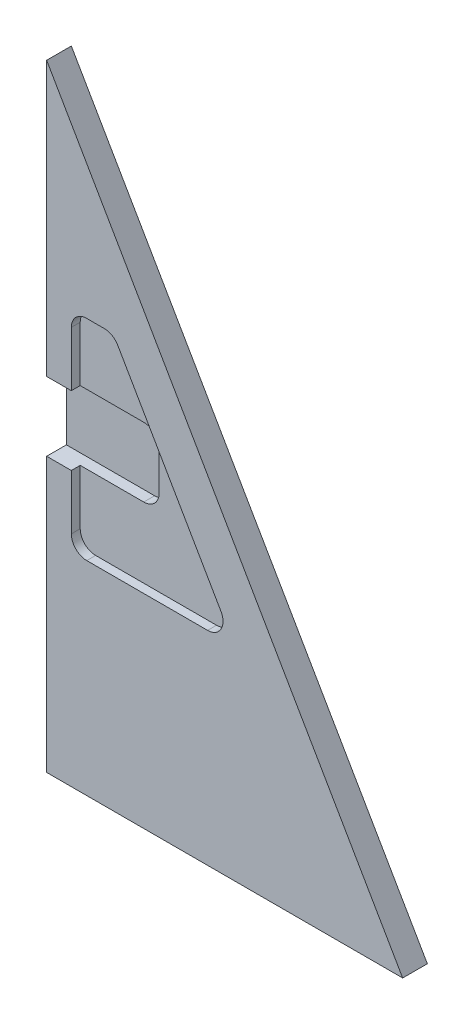
ISO-10303-21;
HEADER;
FILE_DESCRIPTION(('STEP AP214'),'2;1');
FILE_NAME('part.step','',(''),(''),'','','');
FILE_SCHEMA(('AUTOMOTIVE_DESIGN { 1 0 10303 214 1 1 1 1 }'));
ENDSEC;
DATA;
#1=APPLICATION_CONTEXT('core data for automotive mechanical design processes');
#2=APPLICATION_PROTOCOL_DEFINITION('international standard','automotive_design',2000,#1);
#3=PRODUCT_CONTEXT('',#1,'mechanical');
#4=PRODUCT('Part','Part','',(#3));
#5=PRODUCT_RELATED_PRODUCT_CATEGORY('part','',(#4));
#6=PRODUCT_DEFINITION_FORMATION('','',#4);
#7=PRODUCT_DEFINITION_CONTEXT('part definition',#1,'design');
#8=PRODUCT_DEFINITION('design','',#6,#7);
#9=PRODUCT_DEFINITION_SHAPE('','',#8);
#10=(LENGTH_UNIT() NAMED_UNIT(*) SI_UNIT(.MILLI.,.METRE.));
#11=(NAMED_UNIT(*) PLANE_ANGLE_UNIT() SI_UNIT($,.RADIAN.));
#12=(NAMED_UNIT(*) SI_UNIT($,.STERADIAN.) SOLID_ANGLE_UNIT());
#13=UNCERTAINTY_MEASURE_WITH_UNIT(LENGTH_MEASURE(1.E-05),#10,'distance_accuracy_value','');
#14=(GEOMETRIC_REPRESENTATION_CONTEXT(3) GLOBAL_UNCERTAINTY_ASSIGNED_CONTEXT((#13)) GLOBAL_UNIT_ASSIGNED_CONTEXT((#10,
#11,#12)) REPRESENTATION_CONTEXT('',''));
#15=CARTESIAN_POINT('',(0.,0.,0.));
#16=DIRECTION('',(0.,0.,1.));
#17=DIRECTION('',(1.,0.,0.));
#18=AXIS2_PLACEMENT_3D('',#15,#16,#17);
#19=CARTESIAN_POINT('',(0.,0.,-2.54));
#20=DIRECTION('',(-1.,0.,0.));
#21=DIRECTION('',(0.,0.,1.));
#22=AXIS2_PLACEMENT_3D('',#19,#20,#21);
#23=PLANE('',#22);
#24=DIRECTION('',(0.,0.,1.));
#25=VECTOR('',#24,1.);
#26=CARTESIAN_POINT('',(0.,35.306,-2.032));
#27=LINE('',#26,#25);
#28=CARTESIAN_POINT('',(0.,35.306,-2.032));
#29=VERTEX_POINT('',#28);
#30=CARTESIAN_POINT('',(0.,35.306,0.));
#31=VERTEX_POINT('',#30);
#32=EDGE_CURVE('E238',#29,#31,#27,.T.);
#33=ORIENTED_EDGE('',*,*,#32,.T.);
#34=DIRECTION('',(0.,-1.,0.));
#35=VECTOR('',#34,1.);
#36=CARTESIAN_POINT('',(0.,0.,0.));
#37=LINE('',#36,#35);
#38=CARTESIAN_POINT('',(0.,63.5,0.));
#39=VERTEX_POINT('',#38);
#40=EDGE_CURVE('E223',#39,#31,#37,.T.);
#41=ORIENTED_EDGE('',*,*,#40,.F.);
#42=DIRECTION('',(0.,0.,1.));
#43=VECTOR('',#42,1.);
#44=CARTESIAN_POINT('',(0.,63.5,-2.54));
#45=LINE('',#44,#43);
#46=CARTESIAN_POINT('',(0.,63.5,-2.54));
#47=VERTEX_POINT('',#46);
#48=EDGE_CURVE('E267',#47,#39,#45,.T.);
#49=ORIENTED_EDGE('',*,*,#48,.F.);
#50=DIRECTION('',(0.,-1.,0.));
#51=VECTOR('',#50,1.);
#52=CARTESIAN_POINT('',(0.,0.,-2.54));
#53=LINE('',#52,#51);
#54=CARTESIAN_POINT('',(0.,0.,-2.54));
#55=VERTEX_POINT('',#54);
#56=EDGE_CURVE('E246',#47,#55,#53,.T.);
#57=ORIENTED_EDGE('',*,*,#56,.T.);
#58=DIRECTION('',(0.,0.,1.));
#59=VECTOR('',#58,1.);
#60=CARTESIAN_POINT('',(0.,0.,-2.54));
#61=LINE('',#60,#59);
#62=CARTESIAN_POINT('',(0.,0.,0.));
#63=VERTEX_POINT('',#62);
#64=EDGE_CURVE('E259',#55,#63,#61,.T.);
#65=ORIENTED_EDGE('',*,*,#64,.T.);
#66=CARTESIAN_POINT('',(0.,28.194,0.));
#67=VERTEX_POINT('',#66);
#68=EDGE_CURVE('E241',#67,#63,#37,.T.);
#69=ORIENTED_EDGE('',*,*,#68,.F.);
#70=DIRECTION('',(0.,0.,1.));
#71=VECTOR('',#70,1.);
#72=CARTESIAN_POINT('',(0.,28.194,-2.032));
#73=LINE('',#72,#71);
#74=CARTESIAN_POINT('',(0.,28.194,-2.032));
#75=VERTEX_POINT('',#74);
#76=EDGE_CURVE('E242',#75,#67,#73,.T.);
#77=ORIENTED_EDGE('',*,*,#76,.F.);
#78=DIRECTION('',(0.,-1.,0.));
#79=VECTOR('',#78,1.);
#80=CARTESIAN_POINT('',(0.,31.75,-2.032));
#81=LINE('',#80,#79);
#82=EDGE_CURVE('E225',#29,#75,#81,.T.);
#83=ORIENTED_EDGE('',*,*,#82,.F.);
#84=EDGE_LOOP('',(#33,#41,#49,#57,#65,#69,#77,#83));
#85=FACE_BOUND('',#84,.T.);
#86=ADVANCED_FACE('F38',(#85),#23,.T.);
#87=CARTESIAN_POINT('',(0.,63.5,-2.54));
#88=DIRECTION('',(0.866081752896378,0.49990238777179,0.));
#89=DIRECTION('',(-0.49990238777179,0.866081752896378,0.));
#90=AXIS2_PLACEMENT_3D('',#87,#88,#89);
#91=PLANE('',#90);
#92=DIRECTION('',(-0.49990238777179,0.866081752896378,0.));
#93=VECTOR('',#92,1.);
#94=CARTESIAN_POINT('',(0.,63.5,0.));
#95=LINE('',#94,#93);
#96=CARTESIAN_POINT('',(36.6522,0.,0.));
#97=VERTEX_POINT('',#96);
#98=EDGE_CURVE('E251',#97,#39,#95,.T.);
#99=ORIENTED_EDGE('',*,*,#98,.F.);
#100=DIRECTION('',(0.,0.,1.));
#101=VECTOR('',#100,1.);
#102=CARTESIAN_POINT('',(36.6522,0.,-2.54));
#103=LINE('',#102,#101);
#104=CARTESIAN_POINT('',(36.6522,0.,-2.54));
#105=VERTEX_POINT('',#104);
#106=EDGE_CURVE('E271',#105,#97,#103,.T.);
#107=ORIENTED_EDGE('',*,*,#106,.F.);
#108=DIRECTION('',(-0.49990238777179,0.866081752896378,0.));
#109=VECTOR('',#108,1.);
#110=CARTESIAN_POINT('',(0.,63.5,-2.54));
#111=LINE('',#110,#109);
#112=EDGE_CURVE('E255',#105,#47,#111,.T.);
#113=ORIENTED_EDGE('',*,*,#112,.T.);
#114=ORIENTED_EDGE('',*,*,#48,.T.);
#115=EDGE_LOOP('',(#99,#107,#113,#114));
#116=FACE_BOUND('',#115,.T.);
#117=ADVANCED_FACE('F433',(#116),#91,.T.);
#118=CARTESIAN_POINT('',(0.,0.,-2.54));
#119=DIRECTION('',(0.,-1.,0.));
#120=DIRECTION('',(0.,0.,-1.));
#121=AXIS2_PLACEMENT_3D('',#118,#119,#120);
#122=PLANE('',#121);
#123=DIRECTION('',(1.,0.,0.));
#124=VECTOR('',#123,1.);
#125=CARTESIAN_POINT('',(0.,0.,0.));
#126=LINE('',#125,#124);
#127=EDGE_CURVE('E261',#63,#97,#126,.T.);
#128=ORIENTED_EDGE('',*,*,#127,.F.);
#129=ORIENTED_EDGE('',*,*,#64,.F.);
#130=DIRECTION('',(1.,0.,0.));
#131=VECTOR('',#130,1.);
#132=CARTESIAN_POINT('',(0.,0.,-2.54));
#133=LINE('',#132,#131);
#134=EDGE_CURVE('E250',#55,#105,#133,.T.);
#135=ORIENTED_EDGE('',*,*,#134,.T.);
#136=ORIENTED_EDGE('',*,*,#106,.T.);
#137=EDGE_LOOP('',(#128,#129,#135,#136));
#138=FACE_BOUND('',#137,.T.);
#139=ADVANCED_FACE('F437',(#138),#122,.T.);
#140=CARTESIAN_POINT('',(0.,0.,-2.54));
#141=DIRECTION('',(0.,0.,-1.));
#142=DIRECTION('',(-1.,0.,0.));
#143=AXIS2_PLACEMENT_3D('',#140,#141,#142);
#144=PLANE('',#143);
#145=ORIENTED_EDGE('',*,*,#56,.F.);
#146=ORIENTED_EDGE('',*,*,#112,.F.);
#147=ORIENTED_EDGE('',*,*,#134,.F.);
#148=EDGE_LOOP('',(#145,#146,#147));
#149=FACE_BOUND('',#148,.T.);
#150=ADVANCED_FACE('F442',(#149),#144,.T.);
#151=CARTESIAN_POINT('',(0.,0.,0.));
#152=DIRECTION('',(0.,0.,-1.));
#153=DIRECTION('',(-1.,0.,0.));
#154=AXIS2_PLACEMENT_3D('',#151,#152,#153);
#155=PLANE('',#154);
#156=DIRECTION('',(1.,0.,0.));
#157=VECTOR('',#156,1.);
#158=CARTESIAN_POINT('',(2.54000000000009,20.955,0.));
#159=LINE('',#158,#157);
#160=CARTESIAN_POINT('',(4.12750000000009,20.955,0.));
#161=VERTEX_POINT('',#160);
#162=CARTESIAN_POINT('',(16.5704751598497,20.9550000000001,0.));
#163=VERTEX_POINT('',#162);
#164=EDGE_CURVE('E355',#161,#163,#159,.T.);
#165=ORIENTED_EDGE('',*,*,#164,.F.);
#166=CARTESIAN_POINT('',(4.12750000000007,22.5425,0.));
#167=DIRECTION('',(0.,0.,-1.));
#168=DIRECTION('',(-1.,0.,0.));
#169=AXIS2_PLACEMENT_3D('',#166,#167,#168);
#170=CIRCLE('',#169,1.5875);
#171=CARTESIAN_POINT('',(2.54000000000007,22.5425,0.));
#172=VERTEX_POINT('',#171);
#173=EDGE_CURVE('E11',#161,#172,#170,.T.);
#174=ORIENTED_EDGE('',*,*,#173,.T.);
#175=DIRECTION('',(0.,-1.,0.));
#176=VECTOR('',#175,1.);
#177=CARTESIAN_POINT('',(2.54000000000001,31.75,0.));
#178=LINE('',#177,#176);
#179=CARTESIAN_POINT('',(2.54000000000003,28.194,0.));
#180=VERTEX_POINT('',#179);
#181=EDGE_CURVE('E204',#180,#172,#178,.T.);
#182=ORIENTED_EDGE('',*,*,#181,.F.);
#183=DIRECTION('',(1.,0.,0.));
#184=VECTOR('',#183,1.);
#185=CARTESIAN_POINT('',(0.,28.194,0.));
#186=LINE('',#185,#184);
#187=EDGE_CURVE('E217',#67,#180,#186,.T.);
#188=ORIENTED_EDGE('',*,*,#187,.F.);
#189=ORIENTED_EDGE('',*,*,#68,.T.);
#190=ORIENTED_EDGE('',*,*,#127,.T.);
#191=ORIENTED_EDGE('',*,*,#98,.T.);
#192=ORIENTED_EDGE('',*,*,#40,.T.);
#193=DIRECTION('',(-1.,0.,0.));
#194=VECTOR('',#193,1.);
#195=CARTESIAN_POINT('',(0.,35.306,0.));
#196=LINE('',#195,#194);
#197=CARTESIAN_POINT('',(2.53999999999998,35.306,0.));
#198=VERTEX_POINT('',#197);
#199=EDGE_CURVE('E210',#198,#31,#196,.T.);
#200=ORIENTED_EDGE('',*,*,#199,.F.);
#201=CARTESIAN_POINT('',(2.53999999999994,40.9575,0.));
#202=VERTEX_POINT('',#201);
#203=EDGE_CURVE('E194',#202,#198,#178,.T.);
#204=ORIENTED_EDGE('',*,*,#203,.F.);
#205=CARTESIAN_POINT('',(4.12749999999994,40.9575,0.));
#206=DIRECTION('',(0.,0.,-1.));
#207=DIRECTION('',(-1.,0.,0.));
#208=AXIS2_PLACEMENT_3D('',#205,#206,#207);
#209=CIRCLE('',#208,1.5875);
#210=CARTESIAN_POINT('',(4.12749999999993,42.545,0.));
#211=VERTEX_POINT('',#210);
#212=EDGE_CURVE('E332',#202,#211,#209,.T.);
#213=ORIENTED_EDGE('',*,*,#212,.T.);
#214=DIRECTION('',(-1.,0.,0.));
#215=VECTOR('',#214,1.);
#216=CARTESIAN_POINT('',(2.53999999999993,42.545,0.));
#217=LINE('',#216,#215);
#218=CARTESIAN_POINT('',(5.94133715984977,42.545,0.));
#219=VERTEX_POINT('',#218);
#220=EDGE_CURVE('E346',#219,#211,#217,.T.);
#221=ORIENTED_EDGE('',*,*,#220,.F.);
#222=CARTESIAN_POINT('',(5.94133715984978,40.9575,0.));
#223=DIRECTION('',(0.,0.,-1.));
#224=DIRECTION('',(-1.,0.,0.));
#225=AXIS2_PLACEMENT_3D('',#222,#223,#224);
#226=CIRCLE('',#225,1.5875);
#227=CARTESIAN_POINT('',(7.31624194257278,41.7510950405878,0.));
#228=VERTEX_POINT('',#227);
#229=EDGE_CURVE('E340',#219,#228,#226,.T.);
#230=ORIENTED_EDGE('',*,*,#229,.T.);
#231=DIRECTION('',(-0.49990238777179,0.866081752896378,0.));
#232=VECTOR('',#231,1.);
#233=CARTESIAN_POINT('',(19.319748,20.9550000000002,0.));
#234=LINE('',#233,#232);
#235=CARTESIAN_POINT('',(17.9453799425727,23.3360950405878,0.));
#236=VERTEX_POINT('',#235);
#237=EDGE_CURVE('E344',#236,#228,#234,.T.);
#238=ORIENTED_EDGE('',*,*,#237,.F.);
#239=CARTESIAN_POINT('',(16.5704751598497,22.5425000000001,0.));
#240=DIRECTION('',(0.,0.,-1.));
#241=DIRECTION('',(-1.,0.,0.));
#242=AXIS2_PLACEMENT_3D('',#239,#240,#241);
#243=CIRCLE('',#242,1.5875);
#244=EDGE_CURVE('E47',#236,#163,#243,.T.);
#245=ORIENTED_EDGE('',*,*,#244,.T.);
#246=EDGE_LOOP('',(#165,#174,#182,#188,#189,#190,#191,#192,#200,#204,#213,#221,#230,#238,#245));
#247=FACE_BOUND('',#246,.T.);
#248=ADVANCED_FACE('F220',(#247),#155,.F.);
#249=CARTESIAN_POINT('',(0.,35.306,-2.032));
#250=DIRECTION('',(0.,1.,0.));
#251=DIRECTION('',(0.,0.,1.));
#252=AXIS2_PLACEMENT_3D('',#249,#250,#251);
#253=PLANE('',#252);
#254=DIRECTION('',(-1.,0.,0.));
#255=VECTOR('',#254,1.);
#256=CARTESIAN_POINT('',(0.,35.306,-2.032));
#257=LINE('',#256,#255);
#258=CARTESIAN_POINT('',(9.0805,35.306,-2.032));
#259=VERTEX_POINT('',#258);
#260=EDGE_CURVE('E245',#259,#29,#257,.T.);
#261=ORIENTED_EDGE('',*,*,#260,.F.);
#262=DIRECTION('',(0.,0.,1.));
#263=VECTOR('',#262,1.);
#264=CARTESIAN_POINT('',(9.0805,35.306,-0.9144));
#265=LINE('',#264,#263);
#266=CARTESIAN_POINT('',(9.0805,35.306,-0.9144));
#267=VERTEX_POINT('',#266);
#268=EDGE_CURVE('E302',#259,#267,#265,.T.);
#269=ORIENTED_EDGE('',*,*,#268,.T.);
#270=DIRECTION('',(-1.,0.,0.));
#271=VECTOR('',#270,1.);
#272=CARTESIAN_POINT('',(0.,35.306,-0.9144));
#273=LINE('',#272,#271);
#274=CARTESIAN_POINT('',(2.53999999999998,35.306,-0.9144));
#275=VERTEX_POINT('',#274);
#276=EDGE_CURVE('E214',#267,#275,#273,.T.);
#277=ORIENTED_EDGE('',*,*,#276,.T.);
#278=DIRECTION('',(0.,0.,1.));
#279=VECTOR('',#278,1.);
#280=CARTESIAN_POINT('',(2.53999999999998,35.306,-2.032));
#281=LINE('',#280,#279);
#282=EDGE_CURVE('E198',#275,#198,#281,.T.);
#283=ORIENTED_EDGE('',*,*,#282,.T.);
#284=ORIENTED_EDGE('',*,*,#199,.T.);
#285=ORIENTED_EDGE('',*,*,#32,.F.);
#286=EDGE_LOOP('',(#261,#269,#277,#283,#284,#285));
#287=FACE_BOUND('',#286,.T.);
#288=ADVANCED_FACE('F208',(#287),#253,.F.);
#289=CARTESIAN_POINT('',(10.668,35.306,-2.032));
#290=DIRECTION('',(1.,0.,0.));
#291=DIRECTION('',(0.,0.,-1.));
#292=AXIS2_PLACEMENT_3D('',#289,#290,#291);
#293=PLANE('',#292);
#294=DIRECTION('',(0.,1.,0.));
#295=VECTOR('',#294,1.);
#296=CARTESIAN_POINT('',(10.668,35.306,-0.9144));
#297=LINE('',#296,#295);
#298=CARTESIAN_POINT('',(10.668,29.7815,-0.9144));
#299=VERTEX_POINT('',#298);
#300=CARTESIAN_POINT('',(10.668,33.7185,-0.9144));
#301=VERTEX_POINT('',#300);
#302=EDGE_CURVE('E370',#299,#301,#297,.T.);
#303=ORIENTED_EDGE('',*,*,#302,.T.);
#304=DIRECTION('',(0.,0.,1.));
#305=VECTOR('',#304,1.);
#306=CARTESIAN_POINT('',(10.668,33.7185,-2.032));
#307=LINE('',#306,#305);
#308=CARTESIAN_POINT('',(10.668,33.7185,-2.032));
#309=VERTEX_POINT('',#308);
#310=EDGE_CURVE('E308',#301,#309,#307,.F.);
#311=ORIENTED_EDGE('',*,*,#310,.T.);
#312=DIRECTION('',(0.,1.,0.));
#313=VECTOR('',#312,1.);
#314=CARTESIAN_POINT('',(10.668,35.306,-2.032));
#315=LINE('',#314,#313);
#316=CARTESIAN_POINT('',(10.668,29.7815,-2.032));
#317=VERTEX_POINT('',#316);
#318=EDGE_CURVE('E388',#317,#309,#315,.T.);
#319=ORIENTED_EDGE('',*,*,#318,.F.);
#320=DIRECTION('',(0.,0.,1.));
#321=VECTOR('',#320,1.);
#322=CARTESIAN_POINT('',(10.668,29.7815,-0.9144));
#323=LINE('',#322,#321);
#324=EDGE_CURVE('E304',#317,#299,#323,.T.);
#325=ORIENTED_EDGE('',*,*,#324,.T.);
#326=EDGE_LOOP('',(#303,#311,#319,#325));
#327=FACE_BOUND('',#326,.T.);
#328=ADVANCED_FACE('F452',(#327),#293,.F.);
#329=CARTESIAN_POINT('',(0.,28.194,-2.032));
#330=DIRECTION('',(0.,-1.,0.));
#331=DIRECTION('',(0.,0.,-1.));
#332=AXIS2_PLACEMENT_3D('',#329,#330,#331);
#333=PLANE('',#332);
#334=DIRECTION('',(1.,0.,0.));
#335=VECTOR('',#334,1.);
#336=CARTESIAN_POINT('',(0.,28.194,-0.9144));
#337=LINE('',#336,#335);
#338=CARTESIAN_POINT('',(2.54000000000003,28.194,-0.9144));
#339=VERTEX_POINT('',#338);
#340=CARTESIAN_POINT('',(9.0805,28.194,-0.9144));
#341=VERTEX_POINT('',#340);
#342=EDGE_CURVE('E270',#339,#341,#337,.T.);
#343=ORIENTED_EDGE('',*,*,#342,.T.);
#344=DIRECTION('',(0.,0.,1.));
#345=VECTOR('',#344,1.);
#346=CARTESIAN_POINT('',(9.0805,28.194,-2.032));
#347=LINE('',#346,#345);
#348=CARTESIAN_POINT('',(9.0805,28.194,-2.032));
#349=VERTEX_POINT('',#348);
#350=EDGE_CURVE('E315',#341,#349,#347,.F.);
#351=ORIENTED_EDGE('',*,*,#350,.T.);
#352=DIRECTION('',(1.,0.,0.));
#353=VECTOR('',#352,1.);
#354=CARTESIAN_POINT('',(0.,28.194,-2.032));
#355=LINE('',#354,#353);
#356=EDGE_CURVE('E231',#75,#349,#355,.T.);
#357=ORIENTED_EDGE('',*,*,#356,.F.);
#358=ORIENTED_EDGE('',*,*,#76,.T.);
#359=ORIENTED_EDGE('',*,*,#187,.T.);
#360=DIRECTION('',(0.,0.,-1.));
#361=VECTOR('',#360,1.);
#362=CARTESIAN_POINT('',(2.54000000000003,28.194,-2.032));
#363=LINE('',#362,#361);
#364=EDGE_CURVE('E279',#180,#339,#363,.T.);
#365=ORIENTED_EDGE('',*,*,#364,.T.);
#366=EDGE_LOOP('',(#343,#351,#357,#358,#359,#365));
#367=FACE_BOUND('',#366,.T.);
#368=ADVANCED_FACE('F403',(#367),#333,.F.);
#369=CARTESIAN_POINT('',(0.,28.194,-2.032));
#370=DIRECTION('',(0.,0.,1.));
#371=DIRECTION('',(1.,0.,0.));
#372=AXIS2_PLACEMENT_3D('',#369,#370,#371);
#373=PLANE('',#372);
#374=ORIENTED_EDGE('',*,*,#318,.T.);
#375=CARTESIAN_POINT('',(9.0805,33.7185,-2.032));
#376=DIRECTION('',(0.,0.,1.));
#377=DIRECTION('',(1.,0.,0.));
#378=AXIS2_PLACEMENT_3D('',#375,#376,#377);
#379=CIRCLE('',#378,1.5875);
#380=EDGE_CURVE('E313',#309,#259,#379,.T.);
#381=ORIENTED_EDGE('',*,*,#380,.T.);
#382=ORIENTED_EDGE('',*,*,#260,.T.);
#383=ORIENTED_EDGE('',*,*,#82,.T.);
#384=ORIENTED_EDGE('',*,*,#356,.T.);
#385=CARTESIAN_POINT('',(9.0805,29.7815,-2.032));
#386=DIRECTION('',(0.,0.,1.));
#387=DIRECTION('',(1.,0.,0.));
#388=AXIS2_PLACEMENT_3D('',#385,#386,#387);
#389=CIRCLE('',#388,1.5875);
#390=EDGE_CURVE('E310',#349,#317,#389,.T.);
#391=ORIENTED_EDGE('',*,*,#390,.T.);
#392=EDGE_LOOP('',(#374,#381,#382,#383,#384,#391));
#393=FACE_BOUND('',#392,.T.);
#394=ADVANCED_FACE('F394',(#393),#373,.T.);
#395=CARTESIAN_POINT('',(2.54000000000001,31.75,-0.9144));
#396=DIRECTION('',(-1.,0.,0.));
#397=DIRECTION('',(0.,-1.,0.));
#398=AXIS2_PLACEMENT_3D('',#395,#396,#397);
#399=PLANE('',#398);
#400=DIRECTION('',(0.,-1.,0.));
#401=VECTOR('',#400,1.);
#402=CARTESIAN_POINT('',(2.54000000000009,20.955,-0.9144));
#403=LINE('',#402,#401);
#404=CARTESIAN_POINT('',(2.53999999999994,40.9575,-0.9144));
#405=VERTEX_POINT('',#404);
#406=EDGE_CURVE('E410',#405,#275,#403,.T.);
#407=ORIENTED_EDGE('',*,*,#406,.F.);
#408=DIRECTION('',(0.,0.,1.));
#409=VECTOR('',#408,1.);
#410=CARTESIAN_POINT('',(2.53999999999994,40.9575,0.));
#411=LINE('',#410,#409);
#412=EDGE_CURVE('E200',#405,#202,#411,.T.);
#413=ORIENTED_EDGE('',*,*,#412,.T.);
#414=ORIENTED_EDGE('',*,*,#203,.T.);
#415=ORIENTED_EDGE('',*,*,#282,.F.);
#416=EDGE_LOOP('',(#407,#413,#414,#415));
#417=FACE_BOUND('',#416,.T.);
#418=ADVANCED_FACE('F197',(#417),#399,.F.);
#419=ORIENTED_EDGE('',*,*,#181,.T.);
#420=DIRECTION('',(0.,0.,1.));
#421=VECTOR('',#420,1.);
#422=CARTESIAN_POINT('',(2.54000000000007,22.5425,-0.9144));
#423=LINE('',#422,#421);
#424=CARTESIAN_POINT('',(2.54000000000007,22.5425,-0.9144));
#425=VERTEX_POINT('',#424);
#426=EDGE_CURVE('E329',#172,#425,#423,.F.);
#427=ORIENTED_EDGE('',*,*,#426,.T.);
#428=EDGE_CURVE('E203',#339,#425,#403,.T.);
#429=ORIENTED_EDGE('',*,*,#428,.F.);
#430=ORIENTED_EDGE('',*,*,#364,.F.);
#431=EDGE_LOOP('',(#419,#427,#429,#430));
#432=FACE_BOUND('',#431,.T.);
#433=ADVANCED_FACE('F466',(#432),#399,.F.);
#434=CARTESIAN_POINT('',(2.53999999999993,42.545,-0.9144));
#435=DIRECTION('',(0.,0.,-1.));
#436=DIRECTION('',(-1.,0.,0.));
#437=AXIS2_PLACEMENT_3D('',#434,#435,#436);
#438=PLANE('',#437);
#439=DIRECTION('',(-1.,0.,0.));
#440=VECTOR('',#439,1.);
#441=CARTESIAN_POINT('',(2.53999999999993,42.545,-0.9144));
#442=LINE('',#441,#440);
#443=CARTESIAN_POINT('',(5.94133715984977,42.545,-0.9144));
#444=VERTEX_POINT('',#443);
#445=CARTESIAN_POINT('',(4.12749999999993,42.545,-0.9144));
#446=VERTEX_POINT('',#445);
#447=EDGE_CURVE('E363',#444,#446,#442,.T.);
#448=ORIENTED_EDGE('',*,*,#447,.T.);
#449=CARTESIAN_POINT('',(4.12749999999994,40.9575,-0.9144));
#450=DIRECTION('',(0.,0.,-1.));
#451=DIRECTION('',(-1.,0.,0.));
#452=AXIS2_PLACEMENT_3D('',#449,#450,#451);
#453=CIRCLE('',#452,1.5875);
#454=EDGE_CURVE('E300',#446,#405,#453,.F.);
#455=ORIENTED_EDGE('',*,*,#454,.T.);
#456=ORIENTED_EDGE('',*,*,#406,.T.);
#457=ORIENTED_EDGE('',*,*,#276,.F.);
#458=CARTESIAN_POINT('',(9.0805,33.7185,-0.9144));
#459=DIRECTION('',(0.,0.,-1.));
#460=DIRECTION('',(-1.,0.,0.));
#461=AXIS2_PLACEMENT_3D('',#458,#459,#460);
#462=CIRCLE('',#461,1.5875);
#463=EDGE_CURVE('E335',#267,#301,#462,.T.);
#464=ORIENTED_EDGE('',*,*,#463,.T.);
#465=ORIENTED_EDGE('',*,*,#302,.F.);
#466=CARTESIAN_POINT('',(9.0805,29.7815,-0.9144));
#467=DIRECTION('',(0.,0.,-1.));
#468=DIRECTION('',(-1.,0.,0.));
#469=AXIS2_PLACEMENT_3D('',#466,#467,#468);
#470=CIRCLE('',#469,1.5875);
#471=EDGE_CURVE('E337',#299,#341,#470,.T.);
#472=ORIENTED_EDGE('',*,*,#471,.T.);
#473=ORIENTED_EDGE('',*,*,#342,.F.);
#474=ORIENTED_EDGE('',*,*,#428,.T.);
#475=CARTESIAN_POINT('',(4.12750000000007,22.5425,-0.9144));
#476=DIRECTION('',(0.,0.,-1.));
#477=DIRECTION('',(-1.,0.,0.));
#478=AXIS2_PLACEMENT_3D('',#475,#476,#477);
#479=CIRCLE('',#478,1.5875);
#480=CARTESIAN_POINT('',(4.12750000000009,20.955,-0.9144));
#481=VERTEX_POINT('',#480);
#482=EDGE_CURVE('E292',#425,#481,#479,.F.);
#483=ORIENTED_EDGE('',*,*,#482,.T.);
#484=DIRECTION('',(1.,0.,0.));
#485=VECTOR('',#484,1.);
#486=CARTESIAN_POINT('',(2.54000000000009,20.955,-0.9144));
#487=LINE('',#486,#485);
#488=CARTESIAN_POINT('',(16.5704751598497,20.9550000000001,-0.9144));
#489=VERTEX_POINT('',#488);
#490=EDGE_CURVE('E376',#481,#489,#487,.T.);
#491=ORIENTED_EDGE('',*,*,#490,.T.);
#492=CARTESIAN_POINT('',(16.5704751598497,22.5425000000001,-0.9144));
#493=DIRECTION('',(0.,0.,-1.));
#494=DIRECTION('',(-1.,0.,0.));
#495=AXIS2_PLACEMENT_3D('',#492,#493,#494);
#496=CIRCLE('',#495,1.5875);
#497=CARTESIAN_POINT('',(17.9453799425727,23.3360950405878,-0.9144));
#498=VERTEX_POINT('',#497);
#499=EDGE_CURVE('E295',#489,#498,#496,.F.);
#500=ORIENTED_EDGE('',*,*,#499,.T.);
#501=DIRECTION('',(-0.49990238777179,0.866081752896378,0.));
#502=VECTOR('',#501,1.);
#503=CARTESIAN_POINT('',(19.319748,20.9550000000002,-0.9144));
#504=LINE('',#503,#502);
#505=CARTESIAN_POINT('',(7.31624194257278,41.7510950405878,-0.9144));
#506=VERTEX_POINT('',#505);
#507=EDGE_CURVE('E365',#498,#506,#504,.T.);
#508=ORIENTED_EDGE('',*,*,#507,.T.);
#509=CARTESIAN_POINT('',(5.94133715984978,40.9575,-0.9144));
#510=DIRECTION('',(0.,0.,-1.));
#511=DIRECTION('',(-1.,0.,0.));
#512=AXIS2_PLACEMENT_3D('',#509,#510,#511);
#513=CIRCLE('',#512,1.5875);
#514=EDGE_CURVE('E297',#506,#444,#513,.F.);
#515=ORIENTED_EDGE('',*,*,#514,.T.);
#516=EDGE_LOOP('',(#448,#455,#456,#457,#464,#465,#472,#473,#474,#483,#491,#500,#508,#515));
#517=FACE_BOUND('',#516,.T.);
#518=ADVANCED_FACE('F362',(#517),#438,.F.);
#519=CARTESIAN_POINT('',(2.53999999999993,42.545,-0.9144));
#520=DIRECTION('',(0.,1.,0.));
#521=DIRECTION('',(-1.,0.,0.));
#522=AXIS2_PLACEMENT_3D('',#519,#520,#521);
#523=PLANE('',#522);
#524=ORIENTED_EDGE('',*,*,#220,.T.);
#525=DIRECTION('',(0.,0.,1.));
#526=VECTOR('',#525,1.);
#527=CARTESIAN_POINT('',(4.12749999999993,42.545,-0.9144));
#528=LINE('',#527,#526);
#529=EDGE_CURVE('E289',#211,#446,#528,.F.);
#530=ORIENTED_EDGE('',*,*,#529,.T.);
#531=ORIENTED_EDGE('',*,*,#447,.F.);
#532=DIRECTION('',(0.,0.,1.));
#533=VECTOR('',#532,1.);
#534=CARTESIAN_POINT('',(5.94133715984977,42.545,0.));
#535=LINE('',#534,#533);
#536=EDGE_CURVE('E285',#444,#219,#535,.T.);
#537=ORIENTED_EDGE('',*,*,#536,.T.);
#538=EDGE_LOOP('',(#524,#530,#531,#537));
#539=FACE_BOUND('',#538,.T.);
#540=ADVANCED_FACE('F367',(#539),#523,.F.);
#541=CARTESIAN_POINT('',(19.319748,20.9550000000002,-0.9144));
#542=DIRECTION('',(0.866081752896378,0.49990238777179,0.));
#543=DIRECTION('',(-0.49990238777179,0.866081752896378,0.));
#544=AXIS2_PLACEMENT_3D('',#541,#542,#543);
#545=PLANE('',#544);
#546=ORIENTED_EDGE('',*,*,#237,.T.);
#547=DIRECTION('',(0.,0.,1.));
#548=VECTOR('',#547,1.);
#549=CARTESIAN_POINT('',(7.31624194257278,41.7510950405878,-0.9144));
#550=LINE('',#549,#548);
#551=EDGE_CURVE('E321',#228,#506,#550,.F.);
#552=ORIENTED_EDGE('',*,*,#551,.T.);
#553=ORIENTED_EDGE('',*,*,#507,.F.);
#554=DIRECTION('',(0.,0.,1.));
#555=VECTOR('',#554,1.);
#556=CARTESIAN_POINT('',(17.9453799425727,23.3360950405878,0.));
#557=LINE('',#556,#555);
#558=EDGE_CURVE('E318',#498,#236,#557,.T.);
#559=ORIENTED_EDGE('',*,*,#558,.T.);
#560=EDGE_LOOP('',(#546,#552,#553,#559));
#561=FACE_BOUND('',#560,.T.);
#562=ADVANCED_FACE('F351',(#561),#545,.F.);
#563=CARTESIAN_POINT('',(2.54000000000009,20.955,-0.9144));
#564=DIRECTION('',(0.,-1.,0.));
#565=DIRECTION('',(1.,0.,0.));
#566=AXIS2_PLACEMENT_3D('',#563,#564,#565);
#567=PLANE('',#566);
#568=ORIENTED_EDGE('',*,*,#164,.T.);
#569=DIRECTION('',(0.,0.,1.));
#570=VECTOR('',#569,1.);
#571=CARTESIAN_POINT('',(16.5704751598497,20.9550000000001,-0.9144));
#572=LINE('',#571,#570);
#573=EDGE_CURVE('E327',#163,#489,#572,.F.);
#574=ORIENTED_EDGE('',*,*,#573,.T.);
#575=ORIENTED_EDGE('',*,*,#490,.F.);
#576=DIRECTION('',(0.,0.,1.));
#577=VECTOR('',#576,1.);
#578=CARTESIAN_POINT('',(4.12750000000009,20.955,0.));
#579=LINE('',#578,#577);
#580=EDGE_CURVE('E323',#481,#161,#579,.T.);
#581=ORIENTED_EDGE('',*,*,#580,.T.);
#582=EDGE_LOOP('',(#568,#574,#575,#581));
#583=FACE_BOUND('',#582,.T.);
#584=ADVANCED_FACE('F420',(#583),#567,.F.);
#585=CARTESIAN_POINT('',(4.12749999999994,40.9575,-0.9144));
#586=DIRECTION('',(0.,0.,-1.));
#587=DIRECTION('',(-1.,0.,0.));
#588=AXIS2_PLACEMENT_3D('',#585,#586,#587);
#589=CYLINDRICAL_SURFACE('',#588,1.5875);
#590=ORIENTED_EDGE('',*,*,#454,.F.);
#591=ORIENTED_EDGE('',*,*,#529,.F.);
#592=ORIENTED_EDGE('',*,*,#212,.F.);
#593=ORIENTED_EDGE('',*,*,#412,.F.);
#594=EDGE_LOOP('',(#590,#591,#592,#593));
#595=FACE_BOUND('',#594,.T.);
#596=ADVANCED_FACE('F417',(#595),#589,.F.);
#597=CARTESIAN_POINT('',(9.0805,33.7185,-2.032));
#598=DIRECTION('',(0.,0.,-1.));
#599=DIRECTION('',(-1.,0.,0.));
#600=AXIS2_PLACEMENT_3D('',#597,#598,#599);
#601=CYLINDRICAL_SURFACE('',#600,1.5875);
#602=ORIENTED_EDGE('',*,*,#380,.F.);
#603=ORIENTED_EDGE('',*,*,#310,.F.);
#604=ORIENTED_EDGE('',*,*,#463,.F.);
#605=ORIENTED_EDGE('',*,*,#268,.F.);
#606=EDGE_LOOP('',(#602,#603,#604,#605));
#607=FACE_BOUND('',#606,.T.);
#608=ADVANCED_FACE('F419',(#607),#601,.F.);
#609=CARTESIAN_POINT('',(9.0805,29.7815,-2.032));
#610=DIRECTION('',(0.,0.,-1.));
#611=DIRECTION('',(-1.,0.,0.));
#612=AXIS2_PLACEMENT_3D('',#609,#610,#611);
#613=CYLINDRICAL_SURFACE('',#612,1.5875);
#614=ORIENTED_EDGE('',*,*,#390,.F.);
#615=ORIENTED_EDGE('',*,*,#350,.F.);
#616=ORIENTED_EDGE('',*,*,#471,.F.);
#617=ORIENTED_EDGE('',*,*,#324,.F.);
#618=EDGE_LOOP('',(#614,#615,#616,#617));
#619=FACE_BOUND('',#618,.T.);
#620=ADVANCED_FACE('F426',(#619),#613,.F.);
#621=CARTESIAN_POINT('',(5.94133715984978,40.9575,-0.9144));
#622=DIRECTION('',(0.,0.,-1.));
#623=DIRECTION('',(-1.,0.,0.));
#624=AXIS2_PLACEMENT_3D('',#621,#622,#623);
#625=CYLINDRICAL_SURFACE('',#624,1.5875);
#626=ORIENTED_EDGE('',*,*,#514,.F.);
#627=ORIENTED_EDGE('',*,*,#551,.F.);
#628=ORIENTED_EDGE('',*,*,#229,.F.);
#629=ORIENTED_EDGE('',*,*,#536,.F.);
#630=EDGE_LOOP('',(#626,#627,#628,#629));
#631=FACE_BOUND('',#630,.T.);
#632=ADVANCED_FACE('F358',(#631),#625,.F.);
#633=CARTESIAN_POINT('',(16.5704751598497,22.5425000000001,-0.9144));
#634=DIRECTION('',(0.,0.,-1.));
#635=DIRECTION('',(-1.,0.,0.));
#636=AXIS2_PLACEMENT_3D('',#633,#634,#635);
#637=CYLINDRICAL_SURFACE('',#636,1.5875);
#638=ORIENTED_EDGE('',*,*,#499,.F.);
#639=ORIENTED_EDGE('',*,*,#573,.F.);
#640=ORIENTED_EDGE('',*,*,#244,.F.);
#641=ORIENTED_EDGE('',*,*,#558,.F.);
#642=EDGE_LOOP('',(#638,#639,#640,#641));
#643=FACE_BOUND('',#642,.T.);
#644=ADVANCED_FACE('F582',(#643),#637,.F.);
#645=CARTESIAN_POINT('',(4.12750000000007,22.5425,-0.9144));
#646=DIRECTION('',(0.,0.,-1.));
#647=DIRECTION('',(-1.,0.,0.));
#648=AXIS2_PLACEMENT_3D('',#645,#646,#647);
#649=CYLINDRICAL_SURFACE('',#648,1.5875);
#650=ORIENTED_EDGE('',*,*,#482,.F.);
#651=ORIENTED_EDGE('',*,*,#426,.F.);
#652=ORIENTED_EDGE('',*,*,#173,.F.);
#653=ORIENTED_EDGE('',*,*,#580,.F.);
#654=EDGE_LOOP('',(#650,#651,#652,#653));
#655=FACE_BOUND('',#654,.T.);
#656=ADVANCED_FACE('F40',(#655),#649,.F.);
#657=CLOSED_SHELL('',(#86,#117,#139,#150,#248,#288,#328,#368,#394,#418,#433,#518,#540,#562,#584,
#596,#608,#620,#632,#644,#656));
#658=MANIFOLD_SOLID_BREP('B2',#657);
#659=ADVANCED_BREP_SHAPE_REPRESENTATION('',(#18,#658),#14);
#660=SHAPE_DEFINITION_REPRESENTATION(#9,#659);
ENDSEC;
END-ISO-10303-21;
